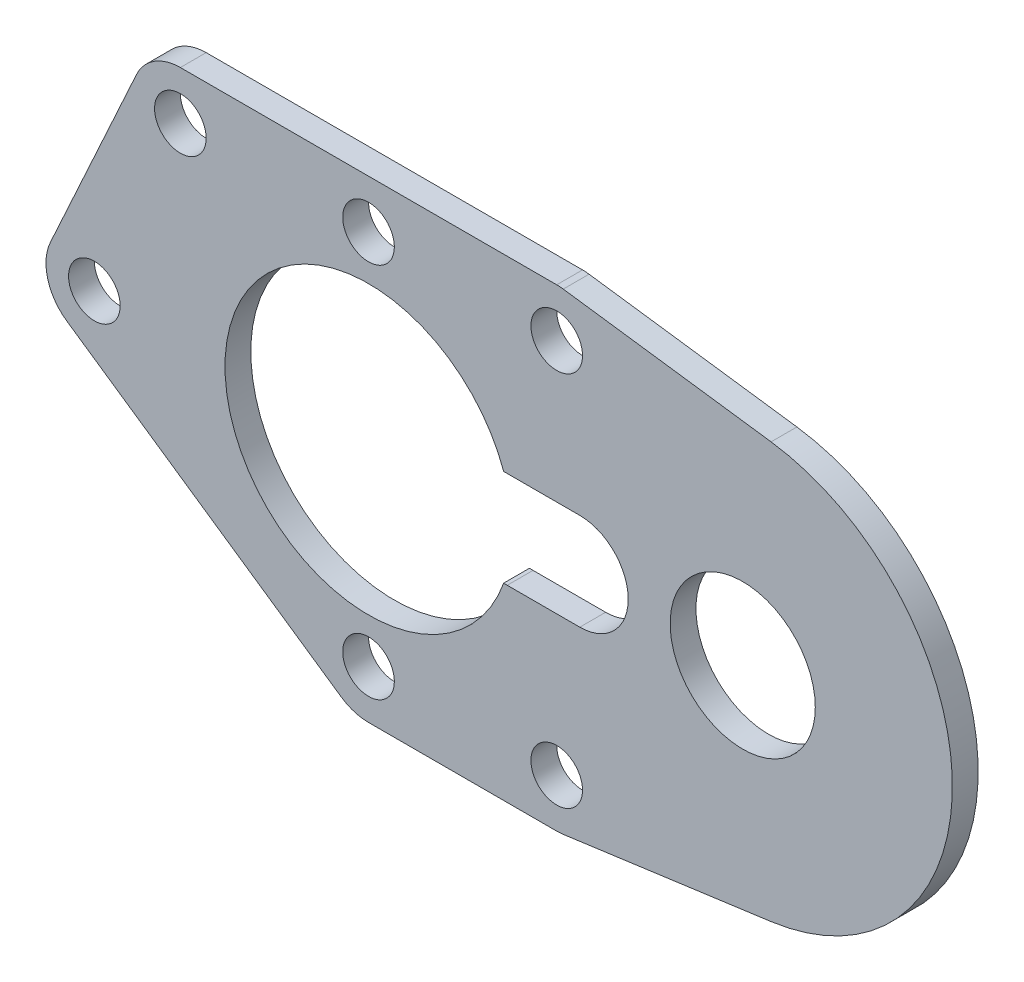
ISO-10303-21;
HEADER;
FILE_DESCRIPTION(('STEP AP214'),'2;1');
FILE_NAME('part.step','',(''),(''),'','','');
FILE_SCHEMA(('AUTOMOTIVE_DESIGN { 1 0 10303 214 1 1 1 1 }'));
ENDSEC;
DATA;
#1=APPLICATION_CONTEXT('core data for automotive mechanical design processes');
#2=APPLICATION_PROTOCOL_DEFINITION('international standard','automotive_design',2000,#1);
#3=PRODUCT_CONTEXT('',#1,'mechanical');
#4=PRODUCT('Part','Part','',(#3));
#5=PRODUCT_RELATED_PRODUCT_CATEGORY('part','',(#4));
#6=PRODUCT_DEFINITION_FORMATION('','',#4);
#7=PRODUCT_DEFINITION_CONTEXT('part definition',#1,'design');
#8=PRODUCT_DEFINITION('design','',#6,#7);
#9=PRODUCT_DEFINITION_SHAPE('','',#8);
#10=(LENGTH_UNIT() NAMED_UNIT(*) SI_UNIT(.MILLI.,.METRE.));
#11=(NAMED_UNIT(*) PLANE_ANGLE_UNIT() SI_UNIT($,.RADIAN.));
#12=(NAMED_UNIT(*) SI_UNIT($,.STERADIAN.) SOLID_ANGLE_UNIT());
#13=UNCERTAINTY_MEASURE_WITH_UNIT(LENGTH_MEASURE(1.E-05),#10,'distance_accuracy_value','');
#14=(GEOMETRIC_REPRESENTATION_CONTEXT(3) GLOBAL_UNCERTAINTY_ASSIGNED_CONTEXT((#13)) GLOBAL_UNIT_ASSIGNED_CONTEXT((#10,
#11,#12)) REPRESENTATION_CONTEXT('',''));
#15=CARTESIAN_POINT('',(0.,0.,0.));
#16=DIRECTION('',(0.,0.,1.));
#17=DIRECTION('',(1.,0.,0.));
#18=AXIS2_PLACEMENT_3D('',#15,#16,#17);
#19=CARTESIAN_POINT('',(8.6,0.,1.6));
#20=DIRECTION('',(0.,0.,-1.));
#21=DIRECTION('',(-1.,0.,0.));
#22=AXIS2_PLACEMENT_3D('',#19,#20,#21);
#23=CYLINDRICAL_SURFACE('',#22,3.);
#24=DIRECTION('',(0.,0.,1.));
#25=VECTOR('',#24,1.);
#26=CARTESIAN_POINT('',(8.38197674418605,2.99206715498237,-13.4));
#27=LINE('',#26,#25);
#28=CARTESIAN_POINT('',(8.38197674418605,2.99206715498237,0.));
#29=VERTEX_POINT('',#28);
#30=CARTESIAN_POINT('',(8.38197674418605,2.99206715498237,1.6));
#31=VERTEX_POINT('',#30);
#32=EDGE_CURVE('E11',#29,#31,#27,.T.);
#33=ORIENTED_EDGE('',*,*,#32,.F.);
#34=CARTESIAN_POINT('',(8.6,0.,0.));
#35=DIRECTION('',(0.,0.,1.));
#36=DIRECTION('',(1.,0.,0.));
#37=AXIS2_PLACEMENT_3D('',#34,#35,#36);
#38=CIRCLE('',#37,3.);
#39=CARTESIAN_POINT('',(8.6,3.,0.));
#40=VERTEX_POINT('',#39);
#41=EDGE_CURVE('E180',#40,#29,#38,.T.);
#42=ORIENTED_EDGE('',*,*,#41,.F.);
#43=DIRECTION('',(0.,0.,-1.));
#44=VECTOR('',#43,1.);
#45=CARTESIAN_POINT('',(8.6,3.,1.6));
#46=LINE('',#45,#44);
#47=CARTESIAN_POINT('',(8.6,3.,1.6));
#48=VERTEX_POINT('',#47);
#49=EDGE_CURVE('E174',#48,#40,#46,.T.);
#50=ORIENTED_EDGE('',*,*,#49,.F.);
#51=CARTESIAN_POINT('',(8.6,0.,1.6));
#52=DIRECTION('',(0.,0.,1.));
#53=DIRECTION('',(1.,0.,0.));
#54=AXIS2_PLACEMENT_3D('',#51,#52,#53);
#55=CIRCLE('',#54,3.);
#56=EDGE_CURVE('E169',#48,#31,#55,.T.);
#57=ORIENTED_EDGE('',*,*,#56,.T.);
#58=EDGE_LOOP('',(#33,#42,#50,#57));
#59=FACE_BOUND('',#58,.T.);
#60=ADVANCED_FACE('F33',(#59),#23,.F.);
#61=CARTESIAN_POINT('',(11.667261889578,11.667261889578,1.6));
#62=DIRECTION('',(0.,0.,1.));
#63=DIRECTION('',(1.,0.,0.));
#64=AXIS2_PLACEMENT_3D('',#61,#62,#63);
#65=PLANE('',#64);
#66=CARTESIAN_POINT('',(0.,0.,1.6));
#67=DIRECTION('',(0.,0.,1.));
#68=DIRECTION('',(1.,0.,0.));
#69=AXIS2_PLACEMENT_3D('',#66,#67,#68);
#70=CIRCLE('',#69,8.9);
#71=CARTESIAN_POINT('',(8.38197674418605,-2.99206715498237,1.6));
#72=VERTEX_POINT('',#71);
#73=EDGE_CURVE('E47',#31,#72,#70,.T.);
#74=ORIENTED_EDGE('',*,*,#73,.F.);
#75=ORIENTED_EDGE('',*,*,#56,.F.);
#76=DIRECTION('',(-1.,0.,0.));
#77=VECTOR('',#76,1.);
#78=CARTESIAN_POINT('',(8.6,3.,1.6));
#79=LINE('',#78,#77);
#80=CARTESIAN_POINT('',(13.1,3.,1.6));
#81=VERTEX_POINT('',#80);
#82=EDGE_CURVE('E331',#81,#48,#79,.T.);
#83=ORIENTED_EDGE('',*,*,#82,.F.);
#84=CARTESIAN_POINT('',(13.1,0.,1.6));
#85=DIRECTION('',(0.,0.,1.));
#86=DIRECTION('',(1.,0.,0.));
#87=AXIS2_PLACEMENT_3D('',#84,#85,#86);
#88=CIRCLE('',#87,3.);
#89=CARTESIAN_POINT('',(13.1,-3.,1.6));
#90=VERTEX_POINT('',#89);
#91=EDGE_CURVE('E334',#90,#81,#88,.T.);
#92=ORIENTED_EDGE('',*,*,#91,.F.);
#93=DIRECTION('',(1.,0.,0.));
#94=VECTOR('',#93,1.);
#95=CARTESIAN_POINT('',(13.1,-3.,1.6));
#96=LINE('',#95,#94);
#97=CARTESIAN_POINT('',(8.6,-3.,1.6));
#98=VERTEX_POINT('',#97);
#99=EDGE_CURVE('E290',#98,#90,#96,.T.);
#100=ORIENTED_EDGE('',*,*,#99,.F.);
#101=EDGE_CURVE('E171',#72,#98,#55,.T.);
#102=ORIENTED_EDGE('',*,*,#101,.F.);
#103=EDGE_LOOP('',(#74,#75,#83,#92,#100,#102));
#104=FACE_BOUND('',#103,.T.);
#105=CARTESIAN_POINT('',(0.,-11.667261889578,1.6));
#106=DIRECTION('',(0.,0.,1.));
#107=DIRECTION('',(1.,0.,0.));
#108=AXIS2_PLACEMENT_3D('',#105,#106,#107);
#109=CIRCLE('',#108,1.6);
#110=CARTESIAN_POINT('',(1.6,-11.667261889578,1.6));
#111=VERTEX_POINT('',#110);
#112=EDGE_CURVE('E310',#111,#111,#109,.T.);
#113=ORIENTED_EDGE('',*,*,#112,.F.);
#114=EDGE_LOOP('',(#113));
#115=FACE_BOUND('',#114,.T.);
#116=CARTESIAN_POINT('',(0.,11.667261889578,1.6));
#117=DIRECTION('',(0.,0.,1.));
#118=DIRECTION('',(1.,0.,0.));
#119=AXIS2_PLACEMENT_3D('',#116,#117,#118);
#120=CIRCLE('',#119,1.6);
#121=CARTESIAN_POINT('',(1.6,11.667261889578,1.6));
#122=VERTEX_POINT('',#121);
#123=EDGE_CURVE('E299',#122,#122,#120,.T.);
#124=ORIENTED_EDGE('',*,*,#123,.F.);
#125=EDGE_LOOP('',(#124));
#126=FACE_BOUND('',#125,.T.);
#127=CARTESIAN_POINT('',(11.667261889578,11.667261889578,1.6));
#128=DIRECTION('',(0.,0.,1.));
#129=DIRECTION('',(1.,0.,0.));
#130=AXIS2_PLACEMENT_3D('',#127,#128,#129);
#131=CIRCLE('',#130,3.);
#132=CARTESIAN_POINT('',(12.0730700536144,14.6396884629355,1.6));
#133=VERTEX_POINT('',#132);
#134=CARTESIAN_POINT('',(11.667261889578,14.667261889578,1.6));
#135=VERTEX_POINT('',#134);
#136=EDGE_CURVE('E195',#133,#135,#131,.T.);
#137=ORIENTED_EDGE('',*,*,#136,.T.);
#138=DIRECTION('',(-1.,0.,0.));
#139=VECTOR('',#138,1.);
#140=CARTESIAN_POINT('',(11.667261889578,14.667261889578,1.6));
#141=LINE('',#140,#139);
#142=CARTESIAN_POINT('',(-11.667261889578,14.667261889578,1.6));
#143=VERTEX_POINT('',#142);
#144=EDGE_CURVE('E198',#135,#143,#141,.T.);
#145=ORIENTED_EDGE('',*,*,#144,.T.);
#146=CARTESIAN_POINT('',(-11.667261889578,11.667261889578,1.6));
#147=DIRECTION('',(0.,0.,1.));
#148=DIRECTION('',(1.,0.,0.));
#149=AXIS2_PLACEMENT_3D('',#146,#147,#148);
#150=CIRCLE('',#149,3.);
#151=CARTESIAN_POINT('',(-14.3957620066574,12.9143733966607,1.6));
#152=VERTEX_POINT('',#151);
#153=EDGE_CURVE('E201',#143,#152,#150,.T.);
#154=ORIENTED_EDGE('',*,*,#153,.T.);
#155=DIRECTION('',(-0.415703835694222,-0.909500039026448,0.));
#156=VECTOR('',#155,1.);
#157=CARTESIAN_POINT('',(-14.3957620066574,12.9143733966607,1.6));
#158=LINE('',#157,#156);
#159=CARTESIAN_POINT('',(-19.7285001170793,1.24711150708266,1.6));
#160=VERTEX_POINT('',#159);
#161=EDGE_CURVE('E203',#152,#160,#158,.T.);
#162=ORIENTED_EDGE('',*,*,#161,.T.);
#163=CARTESIAN_POINT('',(-17.,0.,1.6));
#164=DIRECTION('',(0.,0.,1.));
#165=DIRECTION('',(1.,0.,0.));
#166=AXIS2_PLACEMENT_3D('',#163,#164,#165);
#167=CIRCLE('',#166,3.);
#168=CARTESIAN_POINT('',(-18.6975863662105,-2.47349965216414,1.6));
#169=VERTEX_POINT('',#168);
#170=EDGE_CURVE('E205',#160,#169,#167,.T.);
#171=ORIENTED_EDGE('',*,*,#170,.T.);
#172=DIRECTION('',(0.824499884054712,-0.565862122070179,0.));
#173=VECTOR('',#172,1.);
#174=CARTESIAN_POINT('',(-18.6975863662105,-2.47349965216414,1.6));
#175=LINE('',#174,#173);
#176=CARTESIAN_POINT('',(-1.69758636621054,-14.1407615417422,1.6));
#177=VERTEX_POINT('',#176);
#178=EDGE_CURVE('E207',#169,#177,#175,.T.);
#179=ORIENTED_EDGE('',*,*,#178,.T.);
#180=CARTESIAN_POINT('',(0.,-11.667261889578,1.6));
#181=DIRECTION('',(0.,0.,1.));
#182=DIRECTION('',(1.,0.,0.));
#183=AXIS2_PLACEMENT_3D('',#180,#181,#182);
#184=CIRCLE('',#183,3.);
#185=CARTESIAN_POINT('',(0.,-14.667261889578,1.6));
#186=VERTEX_POINT('',#185);
#187=EDGE_CURVE('E209',#177,#186,#184,.T.);
#188=ORIENTED_EDGE('',*,*,#187,.T.);
#189=DIRECTION('',(1.,0.,0.));
#190=VECTOR('',#189,1.);
#191=CARTESIAN_POINT('',(11.667261889578,-14.667261889578,1.6));
#192=LINE('',#191,#190);
#193=CARTESIAN_POINT('',(11.667261889578,-14.667261889578,1.6));
#194=VERTEX_POINT('',#193);
#195=EDGE_CURVE('E211',#186,#194,#192,.T.);
#196=ORIENTED_EDGE('',*,*,#195,.T.);
#197=CARTESIAN_POINT('',(11.667261889578,-11.667261889578,1.6));
#198=DIRECTION('',(0.,0.,1.));
#199=DIRECTION('',(1.,0.,0.));
#200=AXIS2_PLACEMENT_3D('',#197,#198,#199);
#201=CIRCLE('',#200,3.);
#202=CARTESIAN_POINT('',(12.0730700536144,-14.6396884629355,1.6));
#203=VERTEX_POINT('',#202);
#204=EDGE_CURVE('E213',#194,#203,#201,.T.);
#205=ORIENTED_EDGE('',*,*,#204,.T.);
#206=DIRECTION('',(0.990808857785813,0.135269388012114,0.));
#207=VECTOR('',#206,1.);
#208=CARTESIAN_POINT('',(12.0730700536144,-14.6396884629355,1.6));
#209=LINE('',#208,#207);
#210=CARTESIAN_POINT('',(24.9585020441575,-12.8805151512156,1.6));
#211=VERTEX_POINT('',#210);
#212=EDGE_CURVE('E215',#203,#211,#209,.T.);
#213=ORIENTED_EDGE('',*,*,#212,.T.);
#214=CARTESIAN_POINT('',(23.2,0.,1.6));
#215=DIRECTION('',(0.,0.,1.));
#216=DIRECTION('',(1.,0.,0.));
#217=AXIS2_PLACEMENT_3D('',#214,#215,#216);
#218=CIRCLE('',#217,13.);
#219=CARTESIAN_POINT('',(24.9585020441575,12.8805151512156,1.6));
#220=VERTEX_POINT('',#219);
#221=EDGE_CURVE('E217',#211,#220,#218,.T.);
#222=ORIENTED_EDGE('',*,*,#221,.T.);
#223=DIRECTION('',(-0.990808857785813,0.135269388012114,0.));
#224=VECTOR('',#223,1.);
#225=CARTESIAN_POINT('',(12.0730700536144,14.6396884629355,1.6));
#226=LINE('',#225,#224);
#227=EDGE_CURVE('E219',#220,#133,#226,.T.);
#228=ORIENTED_EDGE('',*,*,#227,.T.);
#229=EDGE_LOOP('',(#137,#145,#154,#162,#171,#179,#188,#196,#205,#213,#222,#228));
#230=FACE_BOUND('',#229,.T.);
#231=CARTESIAN_POINT('',(-17.,0.,1.6));
#232=DIRECTION('',(0.,0.,1.));
#233=DIRECTION('',(1.,0.,0.));
#234=AXIS2_PLACEMENT_3D('',#231,#232,#233);
#235=CIRCLE('',#234,1.6);
#236=CARTESIAN_POINT('',(-15.4,0.,1.6));
#237=VERTEX_POINT('',#236);
#238=EDGE_CURVE('E189',#237,#237,#235,.T.);
#239=ORIENTED_EDGE('',*,*,#238,.F.);
#240=EDGE_LOOP('',(#239));
#241=FACE_BOUND('',#240,.T.);
#242=CARTESIAN_POINT('',(23.2,0.,1.6));
#243=DIRECTION('',(0.,0.,1.));
#244=DIRECTION('',(1.,0.,0.));
#245=AXIS2_PLACEMENT_3D('',#242,#243,#244);
#246=CIRCLE('',#245,4.5);
#247=CARTESIAN_POINT('',(27.7,0.,1.6));
#248=VERTEX_POINT('',#247);
#249=EDGE_CURVE('E178',#248,#248,#246,.T.);
#250=ORIENTED_EDGE('',*,*,#249,.F.);
#251=EDGE_LOOP('',(#250));
#252=FACE_BOUND('',#251,.T.);
#253=CARTESIAN_POINT('',(-11.667261889578,11.667261889578,1.6));
#254=DIRECTION('',(0.,0.,1.));
#255=DIRECTION('',(1.,0.,0.));
#256=AXIS2_PLACEMENT_3D('',#253,#254,#255);
#257=CIRCLE('',#256,1.6);
#258=CARTESIAN_POINT('',(-10.067261889578,11.667261889578,1.6));
#259=VERTEX_POINT('',#258);
#260=EDGE_CURVE('E294',#259,#259,#257,.T.);
#261=ORIENTED_EDGE('',*,*,#260,.F.);
#262=EDGE_LOOP('',(#261));
#263=FACE_BOUND('',#262,.T.);
#264=CARTESIAN_POINT('',(11.667261889578,11.667261889578,1.6));
#265=DIRECTION('',(0.,0.,1.));
#266=DIRECTION('',(1.,0.,0.));
#267=AXIS2_PLACEMENT_3D('',#264,#265,#266);
#268=CIRCLE('',#267,1.6);
#269=CARTESIAN_POINT('',(13.267261889578,11.667261889578,1.6));
#270=VERTEX_POINT('',#269);
#271=EDGE_CURVE('E304',#270,#270,#268,.T.);
#272=ORIENTED_EDGE('',*,*,#271,.F.);
#273=EDGE_LOOP('',(#272));
#274=FACE_BOUND('',#273,.T.);
#275=CARTESIAN_POINT('',(11.667261889578,-11.667261889578,1.6));
#276=DIRECTION('',(0.,0.,1.));
#277=DIRECTION('',(1.,0.,0.));
#278=AXIS2_PLACEMENT_3D('',#275,#276,#277);
#279=CIRCLE('',#278,1.6);
#280=CARTESIAN_POINT('',(13.267261889578,-11.667261889578,1.6));
#281=VERTEX_POINT('',#280);
#282=EDGE_CURVE('E316',#281,#281,#279,.T.);
#283=ORIENTED_EDGE('',*,*,#282,.F.);
#284=EDGE_LOOP('',(#283));
#285=FACE_BOUND('',#284,.T.);
#286=ADVANCED_FACE('F166',(#104,#115,#126,#230,#241,#252,#263,#274,#285),#65,.T.);
#287=CARTESIAN_POINT('',(11.667261889578,11.667261889578,0.));
#288=DIRECTION('',(0.,0.,1.));
#289=DIRECTION('',(1.,0.,0.));
#290=AXIS2_PLACEMENT_3D('',#287,#288,#289);
#291=PLANE('',#290);
#292=CARTESIAN_POINT('',(11.667261889578,11.667261889578,0.));
#293=DIRECTION('',(0.,0.,1.));
#294=DIRECTION('',(1.,0.,0.));
#295=AXIS2_PLACEMENT_3D('',#292,#293,#294);
#296=CIRCLE('',#295,3.);
#297=CARTESIAN_POINT('',(12.0730700536144,14.6396884629355,0.));
#298=VERTEX_POINT('',#297);
#299=CARTESIAN_POINT('',(11.667261889578,14.667261889578,0.));
#300=VERTEX_POINT('',#299);
#301=EDGE_CURVE('E192',#298,#300,#296,.T.);
#302=ORIENTED_EDGE('',*,*,#301,.F.);
#303=DIRECTION('',(-0.990808857785813,0.135269388012114,0.));
#304=VECTOR('',#303,1.);
#305=CARTESIAN_POINT('',(12.0730700536144,14.6396884629355,0.));
#306=LINE('',#305,#304);
#307=CARTESIAN_POINT('',(24.9585020441575,12.8805151512156,0.));
#308=VERTEX_POINT('',#307);
#309=EDGE_CURVE('E199',#308,#298,#306,.T.);
#310=ORIENTED_EDGE('',*,*,#309,.F.);
#311=CARTESIAN_POINT('',(23.2,0.,0.));
#312=DIRECTION('',(0.,0.,1.));
#313=DIRECTION('',(1.,0.,0.));
#314=AXIS2_PLACEMENT_3D('',#311,#312,#313);
#315=CIRCLE('',#314,13.);
#316=CARTESIAN_POINT('',(24.9585020441575,-12.8805151512156,0.));
#317=VERTEX_POINT('',#316);
#318=EDGE_CURVE('E242',#317,#308,#315,.T.);
#319=ORIENTED_EDGE('',*,*,#318,.F.);
#320=DIRECTION('',(0.990808857785813,0.135269388012114,0.));
#321=VECTOR('',#320,1.);
#322=CARTESIAN_POINT('',(12.0730700536144,-14.6396884629355,0.));
#323=LINE('',#322,#321);
#324=CARTESIAN_POINT('',(12.0730700536144,-14.6396884629355,0.));
#325=VERTEX_POINT('',#324);
#326=EDGE_CURVE('E240',#325,#317,#323,.T.);
#327=ORIENTED_EDGE('',*,*,#326,.F.);
#328=CARTESIAN_POINT('',(11.667261889578,-11.667261889578,0.));
#329=DIRECTION('',(0.,0.,1.));
#330=DIRECTION('',(1.,0.,0.));
#331=AXIS2_PLACEMENT_3D('',#328,#329,#330);
#332=CIRCLE('',#331,3.);
#333=CARTESIAN_POINT('',(11.667261889578,-14.667261889578,0.));
#334=VERTEX_POINT('',#333);
#335=EDGE_CURVE('E238',#334,#325,#332,.T.);
#336=ORIENTED_EDGE('',*,*,#335,.F.);
#337=DIRECTION('',(1.,0.,0.));
#338=VECTOR('',#337,1.);
#339=CARTESIAN_POINT('',(11.667261889578,-14.667261889578,0.));
#340=LINE('',#339,#338);
#341=CARTESIAN_POINT('',(0.,-14.667261889578,0.));
#342=VERTEX_POINT('',#341);
#343=EDGE_CURVE('E236',#342,#334,#340,.T.);
#344=ORIENTED_EDGE('',*,*,#343,.F.);
#345=CARTESIAN_POINT('',(0.,-11.667261889578,0.));
#346=DIRECTION('',(0.,0.,1.));
#347=DIRECTION('',(1.,0.,0.));
#348=AXIS2_PLACEMENT_3D('',#345,#346,#347);
#349=CIRCLE('',#348,3.);
#350=CARTESIAN_POINT('',(-1.69758636621054,-14.1407615417422,0.));
#351=VERTEX_POINT('',#350);
#352=EDGE_CURVE('E234',#351,#342,#349,.T.);
#353=ORIENTED_EDGE('',*,*,#352,.F.);
#354=DIRECTION('',(0.824499884054712,-0.565862122070179,0.));
#355=VECTOR('',#354,1.);
#356=CARTESIAN_POINT('',(-18.6975863662105,-2.47349965216414,0.));
#357=LINE('',#356,#355);
#358=CARTESIAN_POINT('',(-18.6975863662105,-2.47349965216414,0.));
#359=VERTEX_POINT('',#358);
#360=EDGE_CURVE('E232',#359,#351,#357,.T.);
#361=ORIENTED_EDGE('',*,*,#360,.F.);
#362=CARTESIAN_POINT('',(-17.,0.,0.));
#363=DIRECTION('',(0.,0.,1.));
#364=DIRECTION('',(1.,0.,0.));
#365=AXIS2_PLACEMENT_3D('',#362,#363,#364);
#366=CIRCLE('',#365,3.);
#367=CARTESIAN_POINT('',(-19.7285001170793,1.24711150708266,0.));
#368=VERTEX_POINT('',#367);
#369=EDGE_CURVE('E230',#368,#359,#366,.T.);
#370=ORIENTED_EDGE('',*,*,#369,.F.);
#371=DIRECTION('',(-0.415703835694222,-0.909500039026448,0.));
#372=VECTOR('',#371,1.);
#373=CARTESIAN_POINT('',(-14.3957620066574,12.9143733966607,0.));
#374=LINE('',#373,#372);
#375=CARTESIAN_POINT('',(-14.3957620066574,12.9143733966607,0.));
#376=VERTEX_POINT('',#375);
#377=EDGE_CURVE('E228',#376,#368,#374,.T.);
#378=ORIENTED_EDGE('',*,*,#377,.F.);
#379=CARTESIAN_POINT('',(-11.667261889578,11.667261889578,0.));
#380=DIRECTION('',(0.,0.,1.));
#381=DIRECTION('',(1.,0.,0.));
#382=AXIS2_PLACEMENT_3D('',#379,#380,#381);
#383=CIRCLE('',#382,3.);
#384=CARTESIAN_POINT('',(-11.667261889578,14.667261889578,0.));
#385=VERTEX_POINT('',#384);
#386=EDGE_CURVE('E226',#385,#376,#383,.T.);
#387=ORIENTED_EDGE('',*,*,#386,.F.);
#388=DIRECTION('',(-1.,0.,0.));
#389=VECTOR('',#388,1.);
#390=CARTESIAN_POINT('',(11.667261889578,14.667261889578,0.));
#391=LINE('',#390,#389);
#392=EDGE_CURVE('E224',#300,#385,#391,.T.);
#393=ORIENTED_EDGE('',*,*,#392,.F.);
#394=EDGE_LOOP('',(#302,#310,#319,#327,#336,#344,#353,#361,#370,#378,#387,#393));
#395=FACE_BOUND('',#394,.T.);
#396=CARTESIAN_POINT('',(-17.,0.,0.));
#397=DIRECTION('',(0.,0.,1.));
#398=DIRECTION('',(1.,0.,0.));
#399=AXIS2_PLACEMENT_3D('',#396,#397,#398);
#400=CIRCLE('',#399,1.6);
#401=CARTESIAN_POINT('',(-15.4,0.,0.));
#402=VERTEX_POINT('',#401);
#403=EDGE_CURVE('E187',#402,#402,#400,.T.);
#404=ORIENTED_EDGE('',*,*,#403,.T.);
#405=EDGE_LOOP('',(#404));
#406=FACE_BOUND('',#405,.T.);
#407=CARTESIAN_POINT('',(23.2,0.,0.));
#408=DIRECTION('',(0.,0.,1.));
#409=DIRECTION('',(1.,0.,0.));
#410=AXIS2_PLACEMENT_3D('',#407,#408,#409);
#411=CIRCLE('',#410,4.5);
#412=CARTESIAN_POINT('',(27.7,0.,0.));
#413=VERTEX_POINT('',#412);
#414=EDGE_CURVE('E175',#413,#413,#411,.T.);
#415=ORIENTED_EDGE('',*,*,#414,.T.);
#416=EDGE_LOOP('',(#415));
#417=FACE_BOUND('',#416,.T.);
#418=ORIENTED_EDGE('',*,*,#41,.T.);
#419=CARTESIAN_POINT('',(0.,0.,0.));
#420=DIRECTION('',(0.,0.,1.));
#421=DIRECTION('',(1.,0.,0.));
#422=AXIS2_PLACEMENT_3D('',#419,#420,#421);
#423=CIRCLE('',#422,8.9);
#424=CARTESIAN_POINT('',(8.38197674418605,-2.99206715498237,0.));
#425=VERTEX_POINT('',#424);
#426=EDGE_CURVE('E158',#29,#425,#423,.T.);
#427=ORIENTED_EDGE('',*,*,#426,.T.);
#428=CARTESIAN_POINT('',(8.6,-3.,0.));
#429=VERTEX_POINT('',#428);
#430=EDGE_CURVE('E55',#425,#429,#38,.T.);
#431=ORIENTED_EDGE('',*,*,#430,.T.);
#432=DIRECTION('',(1.,0.,0.));
#433=VECTOR('',#432,1.);
#434=CARTESIAN_POINT('',(11.667261889578,-3.,0.));
#435=LINE('',#434,#433);
#436=CARTESIAN_POINT('',(13.1,-3.,0.));
#437=VERTEX_POINT('',#436);
#438=EDGE_CURVE('E326',#429,#437,#435,.T.);
#439=ORIENTED_EDGE('',*,*,#438,.T.);
#440=CARTESIAN_POINT('',(13.1,0.,0.));
#441=DIRECTION('',(0.,0.,1.));
#442=DIRECTION('',(1.,0.,0.));
#443=AXIS2_PLACEMENT_3D('',#440,#441,#442);
#444=CIRCLE('',#443,3.);
#445=CARTESIAN_POINT('',(13.1,3.,0.));
#446=VERTEX_POINT('',#445);
#447=EDGE_CURVE('E284',#437,#446,#444,.T.);
#448=ORIENTED_EDGE('',*,*,#447,.T.);
#449=DIRECTION('',(-1.,0.,0.));
#450=VECTOR('',#449,1.);
#451=CARTESIAN_POINT('',(11.667261889578,3.,0.));
#452=LINE('',#451,#450);
#453=EDGE_CURVE('E322',#446,#40,#452,.T.);
#454=ORIENTED_EDGE('',*,*,#453,.T.);
#455=EDGE_LOOP('',(#418,#427,#431,#439,#448,#454));
#456=FACE_BOUND('',#455,.T.);
#457=CARTESIAN_POINT('',(-11.667261889578,11.667261889578,0.));
#458=DIRECTION('',(0.,0.,1.));
#459=DIRECTION('',(1.,0.,0.));
#460=AXIS2_PLACEMENT_3D('',#457,#458,#459);
#461=CIRCLE('',#460,1.6);
#462=CARTESIAN_POINT('',(-10.067261889578,11.667261889578,0.));
#463=VERTEX_POINT('',#462);
#464=EDGE_CURVE('E183',#463,#463,#461,.T.);
#465=ORIENTED_EDGE('',*,*,#464,.T.);
#466=EDGE_LOOP('',(#465));
#467=FACE_BOUND('',#466,.T.);
#468=CARTESIAN_POINT('',(0.,11.667261889578,0.));
#469=DIRECTION('',(0.,0.,1.));
#470=DIRECTION('',(1.,0.,0.));
#471=AXIS2_PLACEMENT_3D('',#468,#469,#470);
#472=CIRCLE('',#471,1.6);
#473=CARTESIAN_POINT('',(1.6,11.667261889578,0.));
#474=VERTEX_POINT('',#473);
#475=EDGE_CURVE('E301',#474,#474,#472,.T.);
#476=ORIENTED_EDGE('',*,*,#475,.T.);
#477=EDGE_LOOP('',(#476));
#478=FACE_BOUND('',#477,.T.);
#479=CARTESIAN_POINT('',(11.667261889578,11.667261889578,0.));
#480=DIRECTION('',(0.,0.,1.));
#481=DIRECTION('',(1.,0.,0.));
#482=AXIS2_PLACEMENT_3D('',#479,#480,#481);
#483=CIRCLE('',#482,1.6);
#484=CARTESIAN_POINT('',(13.267261889578,11.667261889578,0.));
#485=VERTEX_POINT('',#484);
#486=EDGE_CURVE('E307',#485,#485,#483,.T.);
#487=ORIENTED_EDGE('',*,*,#486,.T.);
#488=EDGE_LOOP('',(#487));
#489=FACE_BOUND('',#488,.T.);
#490=CARTESIAN_POINT('',(0.,-11.667261889578,0.));
#491=DIRECTION('',(0.,0.,1.));
#492=DIRECTION('',(1.,0.,0.));
#493=AXIS2_PLACEMENT_3D('',#490,#491,#492);
#494=CIRCLE('',#493,1.6);
#495=CARTESIAN_POINT('',(1.6,-11.667261889578,0.));
#496=VERTEX_POINT('',#495);
#497=EDGE_CURVE('E313',#496,#496,#494,.T.);
#498=ORIENTED_EDGE('',*,*,#497,.T.);
#499=EDGE_LOOP('',(#498));
#500=FACE_BOUND('',#499,.T.);
#501=CARTESIAN_POINT('',(11.667261889578,-11.667261889578,0.));
#502=DIRECTION('',(0.,0.,1.));
#503=DIRECTION('',(1.,0.,0.));
#504=AXIS2_PLACEMENT_3D('',#501,#502,#503);
#505=CIRCLE('',#504,1.6);
#506=CARTESIAN_POINT('',(13.267261889578,-11.667261889578,0.));
#507=VERTEX_POINT('',#506);
#508=EDGE_CURVE('E319',#507,#507,#505,.T.);
#509=ORIENTED_EDGE('',*,*,#508,.T.);
#510=EDGE_LOOP('',(#509));
#511=FACE_BOUND('',#510,.T.);
#512=ADVANCED_FACE('F287',(#395,#406,#417,#456,#467,#478,#489,#500,#511),#291,.F.);
#513=CARTESIAN_POINT('',(11.667261889578,11.667261889578,1.6));
#514=DIRECTION('',(0.,0.,-1.));
#515=DIRECTION('',(-1.,0.,0.));
#516=AXIS2_PLACEMENT_3D('',#513,#514,#515);
#517=CYLINDRICAL_SURFACE('',#516,3.);
#518=ORIENTED_EDGE('',*,*,#301,.T.);
#519=DIRECTION('',(0.,0.,-1.));
#520=VECTOR('',#519,1.);
#521=CARTESIAN_POINT('',(11.667261889578,14.667261889578,1.6));
#522=LINE('',#521,#520);
#523=EDGE_CURVE('E277',#135,#300,#522,.T.);
#524=ORIENTED_EDGE('',*,*,#523,.F.);
#525=ORIENTED_EDGE('',*,*,#136,.F.);
#526=DIRECTION('',(0.,0.,-1.));
#527=VECTOR('',#526,1.);
#528=CARTESIAN_POINT('',(12.0730700536144,14.6396884629355,1.6));
#529=LINE('',#528,#527);
#530=EDGE_CURVE('E221',#133,#298,#529,.T.);
#531=ORIENTED_EDGE('',*,*,#530,.T.);
#532=EDGE_LOOP('',(#518,#524,#525,#531));
#533=FACE_BOUND('',#532,.T.);
#534=ADVANCED_FACE('F35',(#533),#517,.T.);
#535=CARTESIAN_POINT('',(11.667261889578,14.667261889578,1.6));
#536=DIRECTION('',(0.,-1.,0.));
#537=DIRECTION('',(0.,0.,-1.));
#538=AXIS2_PLACEMENT_3D('',#535,#536,#537);
#539=PLANE('',#538);
#540=ORIENTED_EDGE('',*,*,#392,.T.);
#541=DIRECTION('',(0.,0.,-1.));
#542=VECTOR('',#541,1.);
#543=CARTESIAN_POINT('',(-11.667261889578,14.667261889578,1.6));
#544=LINE('',#543,#542);
#545=EDGE_CURVE('E274',#143,#385,#544,.T.);
#546=ORIENTED_EDGE('',*,*,#545,.F.);
#547=ORIENTED_EDGE('',*,*,#144,.F.);
#548=ORIENTED_EDGE('',*,*,#523,.T.);
#549=EDGE_LOOP('',(#540,#546,#547,#548));
#550=FACE_BOUND('',#549,.T.);
#551=ADVANCED_FACE('F425',(#550),#539,.F.);
#552=CARTESIAN_POINT('',(-11.667261889578,11.667261889578,1.6));
#553=DIRECTION('',(0.,0.,-1.));
#554=DIRECTION('',(-1.,0.,0.));
#555=AXIS2_PLACEMENT_3D('',#552,#553,#554);
#556=CYLINDRICAL_SURFACE('',#555,3.);
#557=ORIENTED_EDGE('',*,*,#386,.T.);
#558=DIRECTION('',(0.,0.,-1.));
#559=VECTOR('',#558,1.);
#560=CARTESIAN_POINT('',(-14.3957620066574,12.9143733966607,1.6));
#561=LINE('',#560,#559);
#562=EDGE_CURVE('E271',#152,#376,#561,.T.);
#563=ORIENTED_EDGE('',*,*,#562,.F.);
#564=ORIENTED_EDGE('',*,*,#153,.F.);
#565=ORIENTED_EDGE('',*,*,#545,.T.);
#566=EDGE_LOOP('',(#557,#563,#564,#565));
#567=FACE_BOUND('',#566,.T.);
#568=ADVANCED_FACE('F422',(#567),#556,.T.);
#569=CARTESIAN_POINT('',(-14.3957620066574,12.9143733966607,1.6));
#570=DIRECTION('',(0.909500039026448,-0.415703835694222,0.));
#571=DIRECTION('',(0.415703835694222,0.909500039026448,0.));
#572=AXIS2_PLACEMENT_3D('',#569,#570,#571);
#573=PLANE('',#572);
#574=ORIENTED_EDGE('',*,*,#377,.T.);
#575=DIRECTION('',(0.,0.,-1.));
#576=VECTOR('',#575,1.);
#577=CARTESIAN_POINT('',(-19.7285001170793,1.24711150708266,1.6));
#578=LINE('',#577,#576);
#579=EDGE_CURVE('E268',#160,#368,#578,.T.);
#580=ORIENTED_EDGE('',*,*,#579,.F.);
#581=ORIENTED_EDGE('',*,*,#161,.F.);
#582=ORIENTED_EDGE('',*,*,#562,.T.);
#583=EDGE_LOOP('',(#574,#580,#581,#582));
#584=FACE_BOUND('',#583,.T.);
#585=ADVANCED_FACE('F418',(#584),#573,.F.);
#586=CARTESIAN_POINT('',(-17.,0.,1.6));
#587=DIRECTION('',(0.,0.,-1.));
#588=DIRECTION('',(-1.,0.,0.));
#589=AXIS2_PLACEMENT_3D('',#586,#587,#588);
#590=CYLINDRICAL_SURFACE('',#589,3.);
#591=ORIENTED_EDGE('',*,*,#369,.T.);
#592=DIRECTION('',(0.,0.,-1.));
#593=VECTOR('',#592,1.);
#594=CARTESIAN_POINT('',(-18.6975863662105,-2.47349965216414,1.6));
#595=LINE('',#594,#593);
#596=EDGE_CURVE('E265',#169,#359,#595,.T.);
#597=ORIENTED_EDGE('',*,*,#596,.F.);
#598=ORIENTED_EDGE('',*,*,#170,.F.);
#599=ORIENTED_EDGE('',*,*,#579,.T.);
#600=EDGE_LOOP('',(#591,#597,#598,#599));
#601=FACE_BOUND('',#600,.T.);
#602=ADVANCED_FACE('F414',(#601),#590,.T.);
#603=CARTESIAN_POINT('',(-18.6975863662105,-2.47349965216414,1.6));
#604=DIRECTION('',(0.565862122070179,0.824499884054712,0.));
#605=DIRECTION('',(-0.824499884054712,0.565862122070179,0.));
#606=AXIS2_PLACEMENT_3D('',#603,#604,#605);
#607=PLANE('',#606);
#608=ORIENTED_EDGE('',*,*,#360,.T.);
#609=DIRECTION('',(0.,0.,-1.));
#610=VECTOR('',#609,1.);
#611=CARTESIAN_POINT('',(-1.69758636621054,-14.1407615417422,1.6));
#612=LINE('',#611,#610);
#613=EDGE_CURVE('E262',#177,#351,#612,.T.);
#614=ORIENTED_EDGE('',*,*,#613,.F.);
#615=ORIENTED_EDGE('',*,*,#178,.F.);
#616=ORIENTED_EDGE('',*,*,#596,.T.);
#617=EDGE_LOOP('',(#608,#614,#615,#616));
#618=FACE_BOUND('',#617,.T.);
#619=ADVANCED_FACE('F410',(#618),#607,.F.);
#620=CARTESIAN_POINT('',(0.,-11.667261889578,1.6));
#621=DIRECTION('',(0.,0.,-1.));
#622=DIRECTION('',(-1.,0.,0.));
#623=AXIS2_PLACEMENT_3D('',#620,#621,#622);
#624=CYLINDRICAL_SURFACE('',#623,3.);
#625=ORIENTED_EDGE('',*,*,#352,.T.);
#626=DIRECTION('',(0.,0.,-1.));
#627=VECTOR('',#626,1.);
#628=CARTESIAN_POINT('',(0.,-14.667261889578,1.6));
#629=LINE('',#628,#627);
#630=EDGE_CURVE('E259',#186,#342,#629,.T.);
#631=ORIENTED_EDGE('',*,*,#630,.F.);
#632=ORIENTED_EDGE('',*,*,#187,.F.);
#633=ORIENTED_EDGE('',*,*,#613,.T.);
#634=EDGE_LOOP('',(#625,#631,#632,#633));
#635=FACE_BOUND('',#634,.T.);
#636=ADVANCED_FACE('F406',(#635),#624,.T.);
#637=CARTESIAN_POINT('',(11.667261889578,-14.667261889578,1.6));
#638=DIRECTION('',(0.,1.,0.));
#639=DIRECTION('',(-1.,0.,0.));
#640=AXIS2_PLACEMENT_3D('',#637,#638,#639);
#641=PLANE('',#640);
#642=ORIENTED_EDGE('',*,*,#343,.T.);
#643=DIRECTION('',(0.,0.,-1.));
#644=VECTOR('',#643,1.);
#645=CARTESIAN_POINT('',(11.667261889578,-14.667261889578,1.6));
#646=LINE('',#645,#644);
#647=EDGE_CURVE('E256',#194,#334,#646,.T.);
#648=ORIENTED_EDGE('',*,*,#647,.F.);
#649=ORIENTED_EDGE('',*,*,#195,.F.);
#650=ORIENTED_EDGE('',*,*,#630,.T.);
#651=EDGE_LOOP('',(#642,#648,#649,#650));
#652=FACE_BOUND('',#651,.T.);
#653=ADVANCED_FACE('F402',(#652),#641,.F.);
#654=CARTESIAN_POINT('',(11.667261889578,-11.667261889578,1.6));
#655=DIRECTION('',(0.,0.,-1.));
#656=DIRECTION('',(-1.,0.,0.));
#657=AXIS2_PLACEMENT_3D('',#654,#655,#656);
#658=CYLINDRICAL_SURFACE('',#657,3.);
#659=ORIENTED_EDGE('',*,*,#335,.T.);
#660=DIRECTION('',(0.,0.,-1.));
#661=VECTOR('',#660,1.);
#662=CARTESIAN_POINT('',(12.0730700536144,-14.6396884629355,1.6));
#663=LINE('',#662,#661);
#664=EDGE_CURVE('E253',#203,#325,#663,.T.);
#665=ORIENTED_EDGE('',*,*,#664,.F.);
#666=ORIENTED_EDGE('',*,*,#204,.F.);
#667=ORIENTED_EDGE('',*,*,#647,.T.);
#668=EDGE_LOOP('',(#659,#665,#666,#667));
#669=FACE_BOUND('',#668,.T.);
#670=ADVANCED_FACE('F398',(#669),#658,.T.);
#671=CARTESIAN_POINT('',(12.0730700536144,-14.6396884629355,1.6));
#672=DIRECTION('',(-0.135269388012114,0.990808857785813,0.));
#673=DIRECTION('',(-0.990808857785813,-0.135269388012114,0.));
#674=AXIS2_PLACEMENT_3D('',#671,#672,#673);
#675=PLANE('',#674);
#676=ORIENTED_EDGE('',*,*,#326,.T.);
#677=DIRECTION('',(0.,0.,-1.));
#678=VECTOR('',#677,1.);
#679=CARTESIAN_POINT('',(24.9585020441575,-12.8805151512156,1.6));
#680=LINE('',#679,#678);
#681=EDGE_CURVE('E250',#211,#317,#680,.T.);
#682=ORIENTED_EDGE('',*,*,#681,.F.);
#683=ORIENTED_EDGE('',*,*,#212,.F.);
#684=ORIENTED_EDGE('',*,*,#664,.T.);
#685=EDGE_LOOP('',(#676,#682,#683,#684));
#686=FACE_BOUND('',#685,.T.);
#687=ADVANCED_FACE('F394',(#686),#675,.F.);
#688=CARTESIAN_POINT('',(23.2,0.,1.6));
#689=DIRECTION('',(0.,0.,-1.));
#690=DIRECTION('',(-1.,0.,0.));
#691=AXIS2_PLACEMENT_3D('',#688,#689,#690);
#692=CYLINDRICAL_SURFACE('',#691,13.);
#693=ORIENTED_EDGE('',*,*,#318,.T.);
#694=DIRECTION('',(0.,0.,-1.));
#695=VECTOR('',#694,1.);
#696=CARTESIAN_POINT('',(24.9585020441575,12.8805151512156,1.6));
#697=LINE('',#696,#695);
#698=EDGE_CURVE('E247',#220,#308,#697,.T.);
#699=ORIENTED_EDGE('',*,*,#698,.F.);
#700=ORIENTED_EDGE('',*,*,#221,.F.);
#701=ORIENTED_EDGE('',*,*,#681,.T.);
#702=EDGE_LOOP('',(#693,#699,#700,#701));
#703=FACE_BOUND('',#702,.T.);
#704=ADVANCED_FACE('F390',(#703),#692,.T.);
#705=CARTESIAN_POINT('',(12.0730700536144,14.6396884629355,1.6));
#706=DIRECTION('',(-0.135269388012114,-0.990808857785813,0.));
#707=DIRECTION('',(0.990808857785813,-0.135269388012114,0.));
#708=AXIS2_PLACEMENT_3D('',#705,#706,#707);
#709=PLANE('',#708);
#710=ORIENTED_EDGE('',*,*,#309,.T.);
#711=ORIENTED_EDGE('',*,*,#530,.F.);
#712=ORIENTED_EDGE('',*,*,#227,.F.);
#713=ORIENTED_EDGE('',*,*,#698,.T.);
#714=EDGE_LOOP('',(#710,#711,#712,#713));
#715=FACE_BOUND('',#714,.T.);
#716=ADVANCED_FACE('F381',(#715),#709,.F.);
#717=CARTESIAN_POINT('',(-17.,0.,1.6));
#718=DIRECTION('',(0.,0.,-1.));
#719=DIRECTION('',(-1.,0.,0.));
#720=AXIS2_PLACEMENT_3D('',#717,#718,#719);
#721=CYLINDRICAL_SURFACE('',#720,1.6);
#722=ORIENTED_EDGE('',*,*,#238,.T.);
#723=EDGE_LOOP('',(#722));
#724=FACE_BOUND('',#723,.T.);
#725=ORIENTED_EDGE('',*,*,#403,.F.);
#726=EDGE_LOOP('',(#725));
#727=FACE_BOUND('',#726,.T.);
#728=ADVANCED_FACE('F376',(#724,#727),#721,.F.);
#729=CARTESIAN_POINT('',(23.2,0.,1.6));
#730=DIRECTION('',(0.,0.,-1.));
#731=DIRECTION('',(-1.,0.,0.));
#732=AXIS2_PLACEMENT_3D('',#729,#730,#731);
#733=CYLINDRICAL_SURFACE('',#732,4.5);
#734=ORIENTED_EDGE('',*,*,#249,.T.);
#735=EDGE_LOOP('',(#734));
#736=FACE_BOUND('',#735,.T.);
#737=ORIENTED_EDGE('',*,*,#414,.F.);
#738=EDGE_LOOP('',(#737));
#739=FACE_BOUND('',#738,.T.);
#740=ADVANCED_FACE('F368',(#736,#739),#733,.F.);
#741=DIRECTION('',(0.,0.,1.));
#742=VECTOR('',#741,1.);
#743=CARTESIAN_POINT('',(8.38197674418605,-2.99206715498237,-13.4));
#744=LINE('',#743,#742);
#745=EDGE_CURVE('E41',#72,#425,#744,.F.);
#746=ORIENTED_EDGE('',*,*,#745,.F.);
#747=ORIENTED_EDGE('',*,*,#101,.T.);
#748=DIRECTION('',(0.,0.,-1.));
#749=VECTOR('',#748,1.);
#750=CARTESIAN_POINT('',(8.6,-3.,1.6));
#751=LINE('',#750,#749);
#752=EDGE_CURVE('E280',#98,#429,#751,.T.);
#753=ORIENTED_EDGE('',*,*,#752,.T.);
#754=ORIENTED_EDGE('',*,*,#430,.F.);
#755=EDGE_LOOP('',(#746,#747,#753,#754));
#756=FACE_BOUND('',#755,.T.);
#757=ADVANCED_FACE('F292',(#756),#23,.F.);
#758=CARTESIAN_POINT('',(-11.667261889578,11.667261889578,1.6));
#759=DIRECTION('',(0.,0.,-1.));
#760=DIRECTION('',(-1.,0.,0.));
#761=AXIS2_PLACEMENT_3D('',#758,#759,#760);
#762=CYLINDRICAL_SURFACE('',#761,1.6);
#763=ORIENTED_EDGE('',*,*,#260,.T.);
#764=EDGE_LOOP('',(#763));
#765=FACE_BOUND('',#764,.T.);
#766=ORIENTED_EDGE('',*,*,#464,.F.);
#767=EDGE_LOOP('',(#766));
#768=FACE_BOUND('',#767,.T.);
#769=ADVANCED_FACE('F367',(#765,#768),#762,.F.);
#770=CARTESIAN_POINT('',(0.,11.667261889578,1.6));
#771=DIRECTION('',(0.,0.,-1.));
#772=DIRECTION('',(-1.,0.,0.));
#773=AXIS2_PLACEMENT_3D('',#770,#771,#772);
#774=CYLINDRICAL_SURFACE('',#773,1.6);
#775=ORIENTED_EDGE('',*,*,#123,.T.);
#776=EDGE_LOOP('',(#775));
#777=FACE_BOUND('',#776,.T.);
#778=ORIENTED_EDGE('',*,*,#475,.F.);
#779=EDGE_LOOP('',(#778));
#780=FACE_BOUND('',#779,.T.);
#781=ADVANCED_FACE('F374',(#777,#780),#774,.F.);
#782=CARTESIAN_POINT('',(11.667261889578,11.667261889578,1.6));
#783=DIRECTION('',(0.,0.,-1.));
#784=DIRECTION('',(-1.,0.,0.));
#785=AXIS2_PLACEMENT_3D('',#782,#783,#784);
#786=CYLINDRICAL_SURFACE('',#785,1.6);
#787=ORIENTED_EDGE('',*,*,#271,.T.);
#788=EDGE_LOOP('',(#787));
#789=FACE_BOUND('',#788,.T.);
#790=ORIENTED_EDGE('',*,*,#486,.F.);
#791=EDGE_LOOP('',(#790));
#792=FACE_BOUND('',#791,.T.);
#793=ADVANCED_FACE('F488',(#789,#792),#786,.F.);
#794=CARTESIAN_POINT('',(0.,-11.667261889578,1.6));
#795=DIRECTION('',(0.,0.,-1.));
#796=DIRECTION('',(-1.,0.,0.));
#797=AXIS2_PLACEMENT_3D('',#794,#795,#796);
#798=CYLINDRICAL_SURFACE('',#797,1.6);
#799=ORIENTED_EDGE('',*,*,#112,.T.);
#800=EDGE_LOOP('',(#799));
#801=FACE_BOUND('',#800,.T.);
#802=ORIENTED_EDGE('',*,*,#497,.F.);
#803=EDGE_LOOP('',(#802));
#804=FACE_BOUND('',#803,.T.);
#805=ADVANCED_FACE('F481',(#801,#804),#798,.F.);
#806=CARTESIAN_POINT('',(11.667261889578,-11.667261889578,1.6));
#807=DIRECTION('',(0.,0.,-1.));
#808=DIRECTION('',(-1.,0.,0.));
#809=AXIS2_PLACEMENT_3D('',#806,#807,#808);
#810=CYLINDRICAL_SURFACE('',#809,1.6);
#811=ORIENTED_EDGE('',*,*,#282,.T.);
#812=EDGE_LOOP('',(#811));
#813=FACE_BOUND('',#812,.T.);
#814=ORIENTED_EDGE('',*,*,#508,.F.);
#815=EDGE_LOOP('',(#814));
#816=FACE_BOUND('',#815,.T.);
#817=ADVANCED_FACE('F354',(#813,#816),#810,.F.);
#818=CARTESIAN_POINT('',(13.1,0.,-8.4));
#819=DIRECTION('',(0.,0.,1.));
#820=DIRECTION('',(1.,0.,0.));
#821=AXIS2_PLACEMENT_3D('',#818,#819,#820);
#822=CYLINDRICAL_SURFACE('',#821,3.);
#823=DIRECTION('',(0.,0.,1.));
#824=VECTOR('',#823,1.);
#825=CARTESIAN_POINT('',(13.1,-3.,-8.4));
#826=LINE('',#825,#824);
#827=EDGE_CURVE('E329',#437,#90,#826,.T.);
#828=ORIENTED_EDGE('',*,*,#827,.T.);
#829=ORIENTED_EDGE('',*,*,#91,.T.);
#830=DIRECTION('',(0.,0.,1.));
#831=VECTOR('',#830,1.);
#832=CARTESIAN_POINT('',(13.1,3.,-8.4));
#833=LINE('',#832,#831);
#834=EDGE_CURVE('E328',#446,#81,#833,.T.);
#835=ORIENTED_EDGE('',*,*,#834,.F.);
#836=ORIENTED_EDGE('',*,*,#447,.F.);
#837=EDGE_LOOP('',(#828,#829,#835,#836));
#838=FACE_BOUND('',#837,.T.);
#839=ADVANCED_FACE('F344',(#838),#822,.F.);
#840=CARTESIAN_POINT('',(8.6,3.,-8.4));
#841=DIRECTION('',(0.,1.,0.));
#842=DIRECTION('',(-1.,0.,0.));
#843=AXIS2_PLACEMENT_3D('',#840,#841,#842);
#844=PLANE('',#843);
#845=ORIENTED_EDGE('',*,*,#834,.T.);
#846=ORIENTED_EDGE('',*,*,#82,.T.);
#847=ORIENTED_EDGE('',*,*,#49,.T.);
#848=ORIENTED_EDGE('',*,*,#453,.F.);
#849=EDGE_LOOP('',(#845,#846,#847,#848));
#850=FACE_BOUND('',#849,.T.);
#851=ADVANCED_FACE('F346',(#850),#844,.F.);
#852=CARTESIAN_POINT('',(13.1,-3.,-8.4));
#853=DIRECTION('',(0.,-1.,0.));
#854=DIRECTION('',(1.,0.,0.));
#855=AXIS2_PLACEMENT_3D('',#852,#853,#854);
#856=PLANE('',#855);
#857=ORIENTED_EDGE('',*,*,#752,.F.);
#858=ORIENTED_EDGE('',*,*,#99,.T.);
#859=ORIENTED_EDGE('',*,*,#827,.F.);
#860=ORIENTED_EDGE('',*,*,#438,.F.);
#861=EDGE_LOOP('',(#857,#858,#859,#860));
#862=FACE_BOUND('',#861,.T.);
#863=ADVANCED_FACE('F341',(#862),#856,.F.);
#864=CARTESIAN_POINT('',(0.,0.,-28.4));
#865=DIRECTION('',(0.,0.,1.));
#866=DIRECTION('',(1.,0.,0.));
#867=AXIS2_PLACEMENT_3D('',#864,#865,#866);
#868=CYLINDRICAL_SURFACE('',#867,8.9);
#869=ORIENTED_EDGE('',*,*,#32,.T.);
#870=ORIENTED_EDGE('',*,*,#73,.T.);
#871=ORIENTED_EDGE('',*,*,#745,.T.);
#872=ORIENTED_EDGE('',*,*,#426,.F.);
#873=EDGE_LOOP('',(#869,#870,#871,#872));
#874=FACE_BOUND('',#873,.T.);
#875=ADVANCED_FACE('F157',(#874),#868,.F.);
#876=CLOSED_SHELL('',(#60,#286,#512,#534,#551,#568,#585,#602,#619,#636,#653,#670,#687,#704,#716,
#728,#740,#757,#769,#781,#793,#805,#817,#839,#851,#863,#875));
#877=MANIFOLD_SOLID_BREP('B2',#876);
#878=ADVANCED_BREP_SHAPE_REPRESENTATION('',(#18,#877),#14);
#879=SHAPE_DEFINITION_REPRESENTATION(#9,#878);
ENDSEC;
END-ISO-10303-21;
